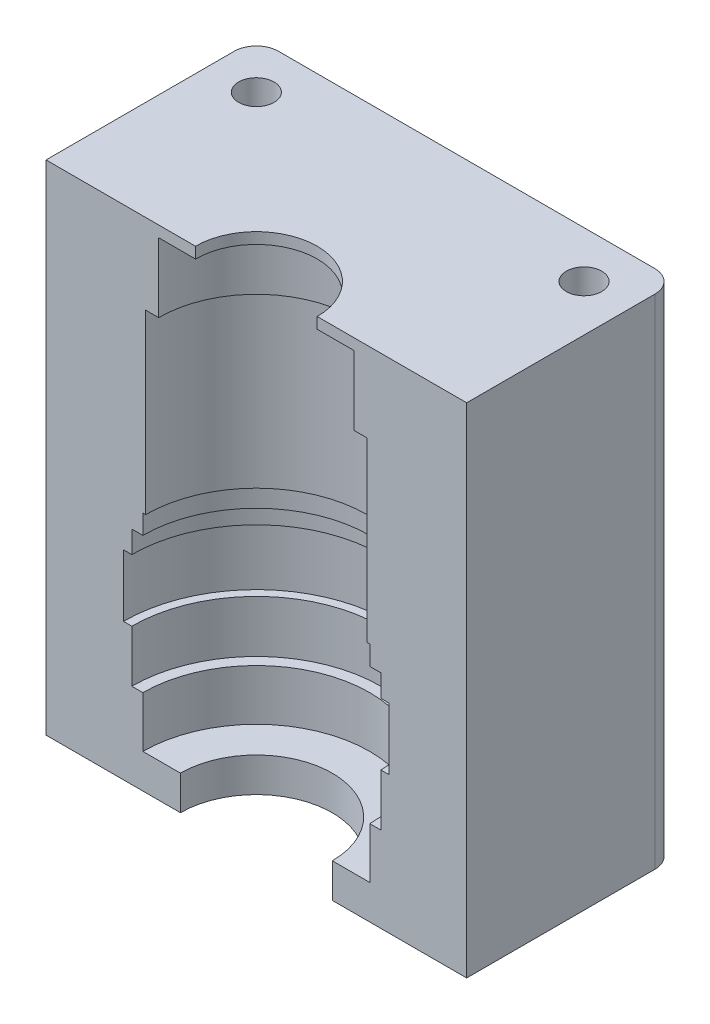
ISO-10303-21;
HEADER;
FILE_DESCRIPTION(('STEP AP214'),'2;1');
FILE_NAME('part.step','',(''),(''),'','','');
FILE_SCHEMA(('AUTOMOTIVE_DESIGN { 1 0 10303 214 1 1 1 1 }'));
ENDSEC;
DATA;
#1=APPLICATION_CONTEXT('core data for automotive mechanical design processes');
#2=APPLICATION_PROTOCOL_DEFINITION('international standard','automotive_design',2000,#1);
#3=PRODUCT_CONTEXT('',#1,'mechanical');
#4=PRODUCT('Part','Part','',(#3));
#5=PRODUCT_RELATED_PRODUCT_CATEGORY('part','',(#4));
#6=PRODUCT_DEFINITION_FORMATION('','',#4);
#7=PRODUCT_DEFINITION_CONTEXT('part definition',#1,'design');
#8=PRODUCT_DEFINITION('design','',#6,#7);
#9=PRODUCT_DEFINITION_SHAPE('','',#8);
#10=(LENGTH_UNIT() NAMED_UNIT(*) SI_UNIT(.MILLI.,.METRE.));
#11=(NAMED_UNIT(*) PLANE_ANGLE_UNIT() SI_UNIT($,.RADIAN.));
#12=(NAMED_UNIT(*) SI_UNIT($,.STERADIAN.) SOLID_ANGLE_UNIT());
#13=UNCERTAINTY_MEASURE_WITH_UNIT(LENGTH_MEASURE(1.E-05),#10,'distance_accuracy_value','');
#14=(GEOMETRIC_REPRESENTATION_CONTEXT(3) GLOBAL_UNCERTAINTY_ASSIGNED_CONTEXT((#13)) GLOBAL_UNIT_ASSIGNED_CONTEXT((#10,
#11,#12)) REPRESENTATION_CONTEXT('',''));
#15=CARTESIAN_POINT('',(0.,0.,0.));
#16=DIRECTION('',(0.,0.,1.));
#17=DIRECTION('',(1.,0.,0.));
#18=AXIS2_PLACEMENT_3D('',#15,#16,#17);
#19=CARTESIAN_POINT('',(0.,0.,0.));
#20=DIRECTION('',(0.,0.,1.));
#21=DIRECTION('',(1.,0.,0.));
#22=AXIS2_PLACEMENT_3D('',#19,#20,#21);
#23=PLANE('',#22);
#24=DIRECTION('',(1.,0.,0.));
#25=VECTOR('',#24,1.);
#26=CARTESIAN_POINT('',(0.,46.6,0.));
#27=LINE('',#26,#25);
#28=CARTESIAN_POINT('',(6.85772410593546,46.6,0.));
#29=VERTEX_POINT('',#28);
#30=CARTESIAN_POINT('',(10.25,46.6,0.));
#31=VERTEX_POINT('',#30);
#32=EDGE_CURVE('E11',#29,#31,#27,.T.);
#33=ORIENTED_EDGE('',*,*,#32,.F.);
#34=DIRECTION('',(0.,-1.,0.));
#35=VECTOR('',#34,1.);
#36=CARTESIAN_POINT('',(6.85772410593546,88.5,0.));
#37=LINE('',#36,#35);
#38=CARTESIAN_POINT('',(6.85772410593546,43.5,0.));
#39=VERTEX_POINT('',#38);
#40=EDGE_CURVE('E248',#39,#29,#37,.F.);
#41=ORIENTED_EDGE('',*,*,#40,.F.);
#42=DIRECTION('',(1.,0.,0.));
#43=VECTOR('',#42,1.);
#44=CARTESIAN_POINT('',(-17.,43.5,0.));
#45=LINE('',#44,#43);
#46=CARTESIAN_POINT('',(19.,43.5,0.));
#47=VERTEX_POINT('',#46);
#48=EDGE_CURVE('E286',#39,#47,#45,.T.);
#49=ORIENTED_EDGE('',*,*,#48,.T.);
#50=DIRECTION('',(0.,1.,0.));
#51=VECTOR('',#50,1.);
#52=CARTESIAN_POINT('',(19.,88.5,0.));
#53=LINE('',#52,#51);
#54=CARTESIAN_POINT('',(19.,88.5,0.));
#55=VERTEX_POINT('',#54);
#56=EDGE_CURVE('E290',#47,#55,#53,.T.);
#57=ORIENTED_EDGE('',*,*,#56,.T.);
#58=DIRECTION('',(1.,0.,0.));
#59=VECTOR('',#58,1.);
#60=CARTESIAN_POINT('',(-17.,88.5,0.));
#61=LINE('',#60,#59);
#62=CARTESIAN_POINT('',(5.5,88.5,0.));
#63=VERTEX_POINT('',#62);
#64=EDGE_CURVE('E231',#63,#55,#61,.T.);
#65=ORIENTED_EDGE('',*,*,#64,.F.);
#66=DIRECTION('',(0.,1.,0.));
#67=VECTOR('',#66,1.);
#68=CARTESIAN_POINT('',(5.5,88.5,0.));
#69=LINE('',#68,#67);
#70=CARTESIAN_POINT('',(5.5,87.5,0.));
#71=VERTEX_POINT('',#70);
#72=EDGE_CURVE('E58',#71,#63,#69,.T.);
#73=ORIENTED_EDGE('',*,*,#72,.F.);
#74=DIRECTION('',(-1.,0.,0.));
#75=VECTOR('',#74,1.);
#76=CARTESIAN_POINT('',(0.,87.5,0.));
#77=LINE('',#76,#75);
#78=CARTESIAN_POINT('',(8.825,87.5,0.));
#79=VERTEX_POINT('',#78);
#80=EDGE_CURVE('E213',#79,#71,#77,.T.);
#81=ORIENTED_EDGE('',*,*,#80,.F.);
#82=DIRECTION('',(0.,1.,0.));
#83=VECTOR('',#82,1.);
#84=CARTESIAN_POINT('',(8.825,88.5,0.));
#85=LINE('',#84,#83);
#86=CARTESIAN_POINT('',(8.825,81.25,0.));
#87=VERTEX_POINT('',#86);
#88=EDGE_CURVE('E221',#87,#79,#85,.T.);
#89=ORIENTED_EDGE('',*,*,#88,.F.);
#90=DIRECTION('',(-1.,0.,0.));
#91=VECTOR('',#90,1.);
#92=CARTESIAN_POINT('',(0.,81.25,0.));
#93=LINE('',#92,#91);
#94=CARTESIAN_POINT('',(10.,81.25,0.));
#95=VERTEX_POINT('',#94);
#96=EDGE_CURVE('E305',#95,#87,#93,.T.);
#97=ORIENTED_EDGE('',*,*,#96,.F.);
#98=DIRECTION('',(0.,1.,0.));
#99=VECTOR('',#98,1.);
#100=CARTESIAN_POINT('',(10.,88.5,0.));
#101=LINE('',#100,#99);
#102=CARTESIAN_POINT('',(10.,65.25,0.));
#103=VERTEX_POINT('',#102);
#104=EDGE_CURVE('E334',#103,#95,#101,.T.);
#105=ORIENTED_EDGE('',*,*,#104,.F.);
#106=DIRECTION('',(-1.,0.,0.));
#107=VECTOR('',#106,1.);
#108=CARTESIAN_POINT('',(0.,65.25,0.));
#109=LINE('',#108,#107);
#110=CARTESIAN_POINT('',(10.25,65.25,0.));
#111=VERTEX_POINT('',#110);
#112=EDGE_CURVE('E310',#111,#103,#109,.T.);
#113=ORIENTED_EDGE('',*,*,#112,.F.);
#114=DIRECTION('',(0.,1.,0.));
#115=VECTOR('',#114,1.);
#116=CARTESIAN_POINT('',(10.25,88.5,0.));
#117=LINE('',#116,#115);
#118=CARTESIAN_POINT('',(10.25,63.5,0.));
#119=VERTEX_POINT('',#118);
#120=EDGE_CURVE('E336',#119,#111,#117,.T.);
#121=ORIENTED_EDGE('',*,*,#120,.F.);
#122=DIRECTION('',(-1.,0.,0.));
#123=VECTOR('',#122,1.);
#124=CARTESIAN_POINT('',(0.,63.5,0.));
#125=LINE('',#124,#123);
#126=CARTESIAN_POINT('',(11.25,63.5,0.));
#127=VERTEX_POINT('',#126);
#128=EDGE_CURVE('E315',#127,#119,#125,.T.);
#129=ORIENTED_EDGE('',*,*,#128,.F.);
#130=DIRECTION('',(0.,1.,0.));
#131=VECTOR('',#130,1.);
#132=CARTESIAN_POINT('',(11.25,88.5,0.));
#133=LINE('',#132,#131);
#134=CARTESIAN_POINT('',(11.25,61.5,0.));
#135=VERTEX_POINT('',#134);
#136=EDGE_CURVE('E338',#135,#127,#133,.T.);
#137=ORIENTED_EDGE('',*,*,#136,.F.);
#138=DIRECTION('',(-1.,0.,0.));
#139=VECTOR('',#138,1.);
#140=CARTESIAN_POINT('',(0.,61.5,0.));
#141=LINE('',#140,#139);
#142=CARTESIAN_POINT('',(12.,61.5,0.));
#143=VERTEX_POINT('',#142);
#144=EDGE_CURVE('E320',#143,#135,#141,.T.);
#145=ORIENTED_EDGE('',*,*,#144,.F.);
#146=DIRECTION('',(0.,1.,0.));
#147=VECTOR('',#146,1.);
#148=CARTESIAN_POINT('',(12.,88.5,0.));
#149=LINE('',#148,#147);
#150=CARTESIAN_POINT('',(12.,55.9,0.));
#151=VERTEX_POINT('',#150);
#152=EDGE_CURVE('E340',#151,#143,#149,.T.);
#153=ORIENTED_EDGE('',*,*,#152,.F.);
#154=DIRECTION('',(-1.,0.,0.));
#155=VECTOR('',#154,1.);
#156=CARTESIAN_POINT('',(0.,55.9,0.));
#157=LINE('',#156,#155);
#158=CARTESIAN_POINT('',(11.25,55.9,0.));
#159=VERTEX_POINT('',#158);
#160=EDGE_CURVE('E326',#151,#159,#157,.T.);
#161=ORIENTED_EDGE('',*,*,#160,.T.);
#162=DIRECTION('',(0.,1.,0.));
#163=VECTOR('',#162,1.);
#164=CARTESIAN_POINT('',(11.25,88.5,0.));
#165=LINE('',#164,#163);
#166=CARTESIAN_POINT('',(11.25,51.2,0.));
#167=VERTEX_POINT('',#166);
#168=EDGE_CURVE('E341',#167,#159,#165,.T.);
#169=ORIENTED_EDGE('',*,*,#168,.F.);
#170=DIRECTION('',(1.,0.,0.));
#171=VECTOR('',#170,1.);
#172=CARTESIAN_POINT('',(0.,51.2,0.));
#173=LINE('',#172,#171);
#174=CARTESIAN_POINT('',(10.25,51.2,0.));
#175=VERTEX_POINT('',#174);
#176=EDGE_CURVE('E331',#175,#167,#173,.T.);
#177=ORIENTED_EDGE('',*,*,#176,.F.);
#178=DIRECTION('',(0.,1.,0.));
#179=VECTOR('',#178,1.);
#180=CARTESIAN_POINT('',(10.25,88.5,0.));
#181=LINE('',#180,#179);
#182=EDGE_CURVE('E45',#31,#175,#181,.T.);
#183=ORIENTED_EDGE('',*,*,#182,.F.);
#184=EDGE_LOOP('',(#33,#41,#49,#57,#65,#73,#81,#89,#97,#105,#113,#121,#129,#137,#145,#153,#161,
#169,#177,#183));
#185=FACE_BOUND('',#184,.T.);
#186=ADVANCED_FACE('F41',(#185),#23,.T.);
#187=CARTESIAN_POINT('',(0.,88.5,0.));
#188=DIRECTION('',(0.,-1.,0.));
#189=DIRECTION('',(0.,0.,-1.));
#190=AXIS2_PLACEMENT_3D('',#187,#188,#189);
#191=CYLINDRICAL_SURFACE('',#190,6.85772410593546);
#192=CARTESIAN_POINT('',(0.,46.6,0.));
#193=DIRECTION('',(0.,-1.,0.));
#194=DIRECTION('',(0.,0.,-1.));
#195=AXIS2_PLACEMENT_3D('',#192,#193,#194);
#196=CIRCLE('',#195,6.85772410593546);
#197=CARTESIAN_POINT('',(-6.85772410593546,46.6,0.));
#198=VERTEX_POINT('',#197);
#199=EDGE_CURVE('E232',#198,#29,#196,.T.);
#200=ORIENTED_EDGE('',*,*,#199,.F.);
#201=DIRECTION('',(0.,-1.,0.));
#202=VECTOR('',#201,1.);
#203=CARTESIAN_POINT('',(-6.85772410593546,88.5,0.));
#204=LINE('',#203,#202);
#205=CARTESIAN_POINT('',(-6.85772410593546,43.5,0.));
#206=VERTEX_POINT('',#205);
#207=EDGE_CURVE('E281',#198,#206,#204,.T.);
#208=ORIENTED_EDGE('',*,*,#207,.T.);
#209=CARTESIAN_POINT('',(0.,43.5,0.));
#210=DIRECTION('',(0.,1.,0.));
#211=DIRECTION('',(0.,0.,1.));
#212=AXIS2_PLACEMENT_3D('',#209,#210,#211);
#213=CIRCLE('',#212,6.85772410593546);
#214=EDGE_CURVE('E242',#39,#206,#213,.T.);
#215=ORIENTED_EDGE('',*,*,#214,.F.);
#216=ORIENTED_EDGE('',*,*,#40,.T.);
#217=EDGE_LOOP('',(#200,#208,#215,#216));
#218=FACE_BOUND('',#217,.T.);
#219=ADVANCED_FACE('F43',(#218),#191,.F.);
#220=CARTESIAN_POINT('',(-10.25,46.6,0.));
#221=VERTEX_POINT('',#220);
#222=EDGE_CURVE('E51',#221,#198,#27,.T.);
#223=ORIENTED_EDGE('',*,*,#222,.F.);
#224=DIRECTION('',(0.,1.,0.));
#225=VECTOR('',#224,1.);
#226=CARTESIAN_POINT('',(-10.25,88.5,0.));
#227=LINE('',#226,#225);
#228=CARTESIAN_POINT('',(-10.25,51.2,0.));
#229=VERTEX_POINT('',#228);
#230=EDGE_CURVE('E330',#229,#221,#227,.F.);
#231=ORIENTED_EDGE('',*,*,#230,.F.);
#232=CARTESIAN_POINT('',(-11.25,51.2,0.));
#233=VERTEX_POINT('',#232);
#234=EDGE_CURVE('E328',#233,#229,#173,.T.);
#235=ORIENTED_EDGE('',*,*,#234,.F.);
#236=DIRECTION('',(0.,1.,0.));
#237=VECTOR('',#236,1.);
#238=CARTESIAN_POINT('',(-11.25,88.5,0.));
#239=LINE('',#238,#237);
#240=CARTESIAN_POINT('',(-11.25,55.9,0.));
#241=VERTEX_POINT('',#240);
#242=EDGE_CURVE('E325',#241,#233,#239,.F.);
#243=ORIENTED_EDGE('',*,*,#242,.F.);
#244=CARTESIAN_POINT('',(-12.,55.9,0.));
#245=VERTEX_POINT('',#244);
#246=EDGE_CURVE('E322',#241,#245,#157,.T.);
#247=ORIENTED_EDGE('',*,*,#246,.T.);
#248=DIRECTION('',(0.,1.,0.));
#249=VECTOR('',#248,1.);
#250=CARTESIAN_POINT('',(-12.,88.5,0.));
#251=LINE('',#250,#249);
#252=CARTESIAN_POINT('',(-12.,61.5,0.));
#253=VERTEX_POINT('',#252);
#254=EDGE_CURVE('E319',#253,#245,#251,.F.);
#255=ORIENTED_EDGE('',*,*,#254,.F.);
#256=CARTESIAN_POINT('',(-11.25,61.5,0.));
#257=VERTEX_POINT('',#256);
#258=EDGE_CURVE('E317',#257,#253,#141,.T.);
#259=ORIENTED_EDGE('',*,*,#258,.F.);
#260=DIRECTION('',(0.,1.,0.));
#261=VECTOR('',#260,1.);
#262=CARTESIAN_POINT('',(-11.25,88.5,0.));
#263=LINE('',#262,#261);
#264=CARTESIAN_POINT('',(-11.25,63.5,0.));
#265=VERTEX_POINT('',#264);
#266=EDGE_CURVE('E314',#265,#257,#263,.F.);
#267=ORIENTED_EDGE('',*,*,#266,.F.);
#268=CARTESIAN_POINT('',(-10.25,63.5,0.));
#269=VERTEX_POINT('',#268);
#270=EDGE_CURVE('E312',#269,#265,#125,.T.);
#271=ORIENTED_EDGE('',*,*,#270,.F.);
#272=DIRECTION('',(0.,1.,0.));
#273=VECTOR('',#272,1.);
#274=CARTESIAN_POINT('',(-10.25,88.5,0.));
#275=LINE('',#274,#273);
#276=CARTESIAN_POINT('',(-10.25,65.25,0.));
#277=VERTEX_POINT('',#276);
#278=EDGE_CURVE('E309',#277,#269,#275,.F.);
#279=ORIENTED_EDGE('',*,*,#278,.F.);
#280=CARTESIAN_POINT('',(-10.,65.25,0.));
#281=VERTEX_POINT('',#280);
#282=EDGE_CURVE('E307',#281,#277,#109,.T.);
#283=ORIENTED_EDGE('',*,*,#282,.F.);
#284=DIRECTION('',(0.,1.,0.));
#285=VECTOR('',#284,1.);
#286=CARTESIAN_POINT('',(-10.,88.5,0.));
#287=LINE('',#286,#285);
#288=CARTESIAN_POINT('',(-10.,81.25,0.));
#289=VERTEX_POINT('',#288);
#290=EDGE_CURVE('E304',#289,#281,#287,.F.);
#291=ORIENTED_EDGE('',*,*,#290,.F.);
#292=CARTESIAN_POINT('',(-8.825,81.25,0.));
#293=VERTEX_POINT('',#292);
#294=EDGE_CURVE('E302',#293,#289,#93,.T.);
#295=ORIENTED_EDGE('',*,*,#294,.F.);
#296=DIRECTION('',(0.,1.,0.));
#297=VECTOR('',#296,1.);
#298=CARTESIAN_POINT('',(-8.825,88.5,0.));
#299=LINE('',#298,#297);
#300=CARTESIAN_POINT('',(-8.825,87.5,0.));
#301=VERTEX_POINT('',#300);
#302=EDGE_CURVE('E300',#301,#293,#299,.F.);
#303=ORIENTED_EDGE('',*,*,#302,.F.);
#304=CARTESIAN_POINT('',(-5.5,87.5,0.));
#305=VERTEX_POINT('',#304);
#306=EDGE_CURVE('E223',#305,#301,#77,.T.);
#307=ORIENTED_EDGE('',*,*,#306,.F.);
#308=DIRECTION('',(0.,1.,0.));
#309=VECTOR('',#308,1.);
#310=CARTESIAN_POINT('',(-5.5,88.5,0.));
#311=LINE('',#310,#309);
#312=CARTESIAN_POINT('',(-5.5,88.5,0.));
#313=VERTEX_POINT('',#312);
#314=EDGE_CURVE('E226',#313,#305,#311,.F.);
#315=ORIENTED_EDGE('',*,*,#314,.F.);
#316=CARTESIAN_POINT('',(-19.,88.5,0.));
#317=VERTEX_POINT('',#316);
#318=EDGE_CURVE('E283',#317,#313,#61,.T.);
#319=ORIENTED_EDGE('',*,*,#318,.F.);
#320=DIRECTION('',(0.,-1.,0.));
#321=VECTOR('',#320,1.);
#322=CARTESIAN_POINT('',(-19.,88.5,0.));
#323=LINE('',#322,#321);
#324=CARTESIAN_POINT('',(-19.,43.5,0.));
#325=VERTEX_POINT('',#324);
#326=EDGE_CURVE('E234',#317,#325,#323,.T.);
#327=ORIENTED_EDGE('',*,*,#326,.T.);
#328=EDGE_CURVE('E289',#325,#206,#45,.T.);
#329=ORIENTED_EDGE('',*,*,#328,.T.);
#330=ORIENTED_EDGE('',*,*,#207,.F.);
#331=EDGE_LOOP('',(#223,#231,#235,#243,#247,#255,#259,#267,#271,#279,#283,#291,#295,#303,#307,
#315,#319,#327,#329,#330));
#332=FACE_BOUND('',#331,.T.);
#333=ADVANCED_FACE('F409',(#332),#23,.T.);
#334=CARTESIAN_POINT('',(17.,88.5,-19.));
#335=DIRECTION('',(0.,0.,1.));
#336=DIRECTION('',(1.,0.,0.));
#337=AXIS2_PLACEMENT_3D('',#334,#335,#336);
#338=PLANE('',#337);
#339=DIRECTION('',(0.,-1.,0.));
#340=VECTOR('',#339,1.);
#341=CARTESIAN_POINT('',(-17.,88.5,-19.));
#342=LINE('',#341,#340);
#343=CARTESIAN_POINT('',(-17.,88.5,-19.));
#344=VERTEX_POINT('',#343);
#345=CARTESIAN_POINT('',(-17.,43.5,-19.));
#346=VERTEX_POINT('',#345);
#347=EDGE_CURVE('E250',#344,#346,#342,.T.);
#348=ORIENTED_EDGE('',*,*,#347,.F.);
#349=DIRECTION('',(1.,0.,0.));
#350=VECTOR('',#349,1.);
#351=CARTESIAN_POINT('',(-17.,88.5,-19.));
#352=LINE('',#351,#350);
#353=CARTESIAN_POINT('',(17.,88.5,-19.));
#354=VERTEX_POINT('',#353);
#355=EDGE_CURVE('E272',#344,#354,#352,.T.);
#356=ORIENTED_EDGE('',*,*,#355,.T.);
#357=DIRECTION('',(0.,-1.,0.));
#358=VECTOR('',#357,1.);
#359=CARTESIAN_POINT('',(17.,88.5,-19.));
#360=LINE('',#359,#358);
#361=CARTESIAN_POINT('',(17.,43.5,-19.));
#362=VERTEX_POINT('',#361);
#363=EDGE_CURVE('E247',#354,#362,#360,.T.);
#364=ORIENTED_EDGE('',*,*,#363,.T.);
#365=DIRECTION('',(-1.,0.,0.));
#366=VECTOR('',#365,1.);
#367=CARTESIAN_POINT('',(17.,43.5,-19.));
#368=LINE('',#367,#366);
#369=EDGE_CURVE('E258',#362,#346,#368,.T.);
#370=ORIENTED_EDGE('',*,*,#369,.T.);
#371=EDGE_LOOP('',(#348,#356,#364,#370));
#372=FACE_BOUND('',#371,.T.);
#373=ADVANCED_FACE('F434',(#372),#338,.F.);
#374=CARTESIAN_POINT('',(14.8,88.5,-14.8));
#375=DIRECTION('',(0.,-1.,0.));
#376=DIRECTION('',(0.,0.,-1.));
#377=AXIS2_PLACEMENT_3D('',#374,#375,#376);
#378=CYLINDRICAL_SURFACE('',#377,1.6);
#379=CARTESIAN_POINT('',(14.8,88.5,-14.8));
#380=DIRECTION('',(0.,-1.,0.));
#381=DIRECTION('',(0.,0.,-1.));
#382=AXIS2_PLACEMENT_3D('',#379,#380,#381);
#383=CIRCLE('',#382,1.6);
#384=CARTESIAN_POINT('',(14.8,88.5,-16.4));
#385=VERTEX_POINT('',#384);
#386=EDGE_CURVE('E245',#385,#385,#383,.T.);
#387=ORIENTED_EDGE('',*,*,#386,.F.);
#388=EDGE_LOOP('',(#387));
#389=FACE_BOUND('',#388,.T.);
#390=CARTESIAN_POINT('',(14.8,43.5,-14.8));
#391=DIRECTION('',(0.,1.,0.));
#392=DIRECTION('',(0.,0.,1.));
#393=AXIS2_PLACEMENT_3D('',#390,#391,#392);
#394=CIRCLE('',#393,1.6);
#395=CARTESIAN_POINT('',(14.8,43.5,-13.2));
#396=VERTEX_POINT('',#395);
#397=EDGE_CURVE('E238',#396,#396,#394,.T.);
#398=ORIENTED_EDGE('',*,*,#397,.F.);
#399=EDGE_LOOP('',(#398));
#400=FACE_BOUND('',#399,.T.);
#401=ADVANCED_FACE('F501',(#389,#400),#378,.F.);
#402=CARTESIAN_POINT('',(-14.8,88.5,-14.8));
#403=DIRECTION('',(0.,-1.,0.));
#404=DIRECTION('',(0.,0.,-1.));
#405=AXIS2_PLACEMENT_3D('',#402,#403,#404);
#406=CYLINDRICAL_SURFACE('',#405,1.6);
#407=CARTESIAN_POINT('',(-14.8,88.5,-14.8));
#408=DIRECTION('',(0.,-1.,0.));
#409=DIRECTION('',(0.,0.,-1.));
#410=AXIS2_PLACEMENT_3D('',#407,#408,#409);
#411=CIRCLE('',#410,1.6);
#412=CARTESIAN_POINT('',(-14.8,88.5,-16.4));
#413=VERTEX_POINT('',#412);
#414=EDGE_CURVE('E264',#413,#413,#411,.T.);
#415=ORIENTED_EDGE('',*,*,#414,.F.);
#416=EDGE_LOOP('',(#415));
#417=FACE_BOUND('',#416,.T.);
#418=CARTESIAN_POINT('',(-14.8,43.5,-14.8));
#419=DIRECTION('',(0.,1.,0.));
#420=DIRECTION('',(0.,0.,1.));
#421=AXIS2_PLACEMENT_3D('',#418,#419,#420);
#422=CIRCLE('',#421,1.6);
#423=CARTESIAN_POINT('',(-14.8,43.5,-13.2));
#424=VERTEX_POINT('',#423);
#425=EDGE_CURVE('E241',#424,#424,#422,.T.);
#426=ORIENTED_EDGE('',*,*,#425,.F.);
#427=EDGE_LOOP('',(#426));
#428=FACE_BOUND('',#427,.T.);
#429=ADVANCED_FACE('F682',(#417,#428),#406,.F.);
#430=CARTESIAN_POINT('',(17.,88.5,-17.));
#431=DIRECTION('',(0.,-1.,0.));
#432=DIRECTION('',(0.,0.,-1.));
#433=AXIS2_PLACEMENT_3D('',#430,#431,#432);
#434=CYLINDRICAL_SURFACE('',#433,2.);
#435=ORIENTED_EDGE('',*,*,#363,.F.);
#436=CARTESIAN_POINT('',(17.,88.5,-17.));
#437=DIRECTION('',(0.,1.,0.));
#438=DIRECTION('',(0.,0.,1.));
#439=AXIS2_PLACEMENT_3D('',#436,#437,#438);
#440=CIRCLE('',#439,2.);
#441=CARTESIAN_POINT('',(19.,88.5,-17.));
#442=VERTEX_POINT('',#441);
#443=EDGE_CURVE('E275',#354,#442,#440,.F.);
#444=ORIENTED_EDGE('',*,*,#443,.T.);
#445=DIRECTION('',(0.,-1.,0.));
#446=VECTOR('',#445,1.);
#447=CARTESIAN_POINT('',(19.,88.5,-17.));
#448=LINE('',#447,#446);
#449=CARTESIAN_POINT('',(19.,43.5,-17.));
#450=VERTEX_POINT('',#449);
#451=EDGE_CURVE('E67',#442,#450,#448,.T.);
#452=ORIENTED_EDGE('',*,*,#451,.T.);
#453=CARTESIAN_POINT('',(17.,43.5,-17.));
#454=DIRECTION('',(0.,1.,0.));
#455=DIRECTION('',(0.,0.,1.));
#456=AXIS2_PLACEMENT_3D('',#453,#454,#455);
#457=CIRCLE('',#456,2.);
#458=EDGE_CURVE('E261',#450,#362,#457,.T.);
#459=ORIENTED_EDGE('',*,*,#458,.T.);
#460=EDGE_LOOP('',(#435,#444,#452,#459));
#461=FACE_BOUND('',#460,.T.);
#462=ADVANCED_FACE('F431',(#461),#434,.T.);
#463=CARTESIAN_POINT('',(-17.,88.5,-17.));
#464=DIRECTION('',(0.,-1.,0.));
#465=DIRECTION('',(0.,0.,-1.));
#466=AXIS2_PLACEMENT_3D('',#463,#464,#465);
#467=CYLINDRICAL_SURFACE('',#466,2.);
#468=DIRECTION('',(0.,-1.,0.));
#469=VECTOR('',#468,1.);
#470=CARTESIAN_POINT('',(-19.,88.5,-17.));
#471=LINE('',#470,#469);
#472=CARTESIAN_POINT('',(-19.,88.5,-17.));
#473=VERTEX_POINT('',#472);
#474=CARTESIAN_POINT('',(-19.,43.5,-17.));
#475=VERTEX_POINT('',#474);
#476=EDGE_CURVE('E252',#473,#475,#471,.T.);
#477=ORIENTED_EDGE('',*,*,#476,.F.);
#478=CARTESIAN_POINT('',(-17.,88.5,-17.));
#479=DIRECTION('',(0.,1.,0.));
#480=DIRECTION('',(0.,0.,1.));
#481=AXIS2_PLACEMENT_3D('',#478,#479,#480);
#482=CIRCLE('',#481,2.);
#483=EDGE_CURVE('E269',#473,#344,#482,.F.);
#484=ORIENTED_EDGE('',*,*,#483,.T.);
#485=ORIENTED_EDGE('',*,*,#347,.T.);
#486=CARTESIAN_POINT('',(-17.,43.5,-17.));
#487=DIRECTION('',(0.,1.,0.));
#488=DIRECTION('',(0.,0.,1.));
#489=AXIS2_PLACEMENT_3D('',#486,#487,#488);
#490=CIRCLE('',#489,2.);
#491=EDGE_CURVE('E255',#346,#475,#490,.T.);
#492=ORIENTED_EDGE('',*,*,#491,.T.);
#493=EDGE_LOOP('',(#477,#484,#485,#492));
#494=FACE_BOUND('',#493,.T.);
#495=ADVANCED_FACE('F438',(#494),#467,.T.);
#496=CARTESIAN_POINT('',(-17.,43.5,17.));
#497=DIRECTION('',(0.,1.,0.));
#498=DIRECTION('',(0.,0.,1.));
#499=AXIS2_PLACEMENT_3D('',#496,#497,#498);
#500=PLANE('',#499);
#501=ORIENTED_EDGE('',*,*,#425,.T.);
#502=EDGE_LOOP('',(#501));
#503=FACE_BOUND('',#502,.T.);
#504=ORIENTED_EDGE('',*,*,#397,.T.);
#505=EDGE_LOOP('',(#504));
#506=FACE_BOUND('',#505,.T.);
#507=ORIENTED_EDGE('',*,*,#328,.F.);
#508=DIRECTION('',(0.,0.,1.));
#509=VECTOR('',#508,1.);
#510=CARTESIAN_POINT('',(-19.,43.5,-17.));
#511=LINE('',#510,#509);
#512=EDGE_CURVE('E254',#475,#325,#511,.T.);
#513=ORIENTED_EDGE('',*,*,#512,.F.);
#514=ORIENTED_EDGE('',*,*,#491,.F.);
#515=ORIENTED_EDGE('',*,*,#369,.F.);
#516=ORIENTED_EDGE('',*,*,#458,.F.);
#517=DIRECTION('',(0.,0.,-1.));
#518=VECTOR('',#517,1.);
#519=CARTESIAN_POINT('',(19.,43.5,17.));
#520=LINE('',#519,#518);
#521=EDGE_CURVE('E87',#47,#450,#520,.T.);
#522=ORIENTED_EDGE('',*,*,#521,.F.);
#523=ORIENTED_EDGE('',*,*,#48,.F.);
#524=ORIENTED_EDGE('',*,*,#214,.T.);
#525=EDGE_LOOP('',(#507,#513,#514,#515,#516,#522,#523,#524));
#526=FACE_BOUND('',#525,.T.);
#527=ADVANCED_FACE('F421',(#503,#506,#526),#500,.F.);
#528=CARTESIAN_POINT('',(-17.,88.5,17.));
#529=DIRECTION('',(0.,1.,0.));
#530=DIRECTION('',(0.,0.,1.));
#531=AXIS2_PLACEMENT_3D('',#528,#529,#530);
#532=PLANE('',#531);
#533=CARTESIAN_POINT('',(0.,88.5,0.));
#534=DIRECTION('',(0.,1.,0.));
#535=DIRECTION('',(0.,0.,1.));
#536=AXIS2_PLACEMENT_3D('',#533,#534,#535);
#537=CIRCLE('',#536,5.5);
#538=EDGE_CURVE('E391',#63,#313,#537,.T.);
#539=ORIENTED_EDGE('',*,*,#538,.F.);
#540=ORIENTED_EDGE('',*,*,#64,.T.);
#541=DIRECTION('',(0.,0.,1.));
#542=VECTOR('',#541,1.);
#543=CARTESIAN_POINT('',(19.,88.5,-17.));
#544=LINE('',#543,#542);
#545=EDGE_CURVE('E278',#442,#55,#544,.T.);
#546=ORIENTED_EDGE('',*,*,#545,.F.);
#547=ORIENTED_EDGE('',*,*,#443,.F.);
#548=ORIENTED_EDGE('',*,*,#355,.F.);
#549=ORIENTED_EDGE('',*,*,#483,.F.);
#550=DIRECTION('',(0.,0.,-1.));
#551=VECTOR('',#550,1.);
#552=CARTESIAN_POINT('',(-19.,88.5,17.));
#553=LINE('',#552,#551);
#554=EDGE_CURVE('E80',#317,#473,#553,.T.);
#555=ORIENTED_EDGE('',*,*,#554,.F.);
#556=ORIENTED_EDGE('',*,*,#318,.T.);
#557=EDGE_LOOP('',(#539,#540,#546,#547,#548,#549,#555,#556));
#558=FACE_BOUND('',#557,.T.);
#559=ORIENTED_EDGE('',*,*,#414,.T.);
#560=EDGE_LOOP('',(#559));
#561=FACE_BOUND('',#560,.T.);
#562=ORIENTED_EDGE('',*,*,#386,.T.);
#563=EDGE_LOOP('',(#562));
#564=FACE_BOUND('',#563,.T.);
#565=ADVANCED_FACE('F427',(#558,#561,#564),#532,.T.);
#566=CARTESIAN_POINT('',(-19.,88.5,-17.));
#567=DIRECTION('',(1.,0.,0.));
#568=DIRECTION('',(0.,0.,-1.));
#569=AXIS2_PLACEMENT_3D('',#566,#567,#568);
#570=PLANE('',#569);
#571=ORIENTED_EDGE('',*,*,#326,.F.);
#572=ORIENTED_EDGE('',*,*,#554,.T.);
#573=ORIENTED_EDGE('',*,*,#476,.T.);
#574=ORIENTED_EDGE('',*,*,#512,.T.);
#575=EDGE_LOOP('',(#571,#572,#573,#574));
#576=FACE_BOUND('',#575,.T.);
#577=ADVANCED_FACE('F439',(#576),#570,.F.);
#578=CARTESIAN_POINT('',(19.,88.5,17.));
#579=DIRECTION('',(-1.,0.,0.));
#580=DIRECTION('',(0.,0.,1.));
#581=AXIS2_PLACEMENT_3D('',#578,#579,#580);
#582=PLANE('',#581);
#583=ORIENTED_EDGE('',*,*,#56,.F.);
#584=ORIENTED_EDGE('',*,*,#521,.T.);
#585=ORIENTED_EDGE('',*,*,#451,.F.);
#586=ORIENTED_EDGE('',*,*,#545,.T.);
#587=EDGE_LOOP('',(#583,#584,#585,#586));
#588=FACE_BOUND('',#587,.T.);
#589=ADVANCED_FACE('F424',(#588),#582,.F.);
#590=CARTESIAN_POINT('',(0.,87.5,0.));
#591=DIRECTION('',(0.,1.,0.));
#592=DIRECTION('',(0.,0.,1.));
#593=AXIS2_PLACEMENT_3D('',#590,#591,#592);
#594=PLANE('',#593);
#595=ORIENTED_EDGE('',*,*,#80,.T.);
#596=CARTESIAN_POINT('',(0.,87.5,0.));
#597=DIRECTION('',(0.,1.,0.));
#598=DIRECTION('',(0.,0.,1.));
#599=AXIS2_PLACEMENT_3D('',#596,#597,#598);
#600=CIRCLE('',#599,5.5);
#601=EDGE_CURVE('E215',#71,#305,#600,.T.);
#602=ORIENTED_EDGE('',*,*,#601,.T.);
#603=ORIENTED_EDGE('',*,*,#306,.T.);
#604=CARTESIAN_POINT('',(0.,87.5,0.));
#605=DIRECTION('',(0.,1.,0.));
#606=DIRECTION('',(0.,0.,1.));
#607=AXIS2_PLACEMENT_3D('',#604,#605,#606);
#608=CIRCLE('',#607,8.825);
#609=EDGE_CURVE('E218',#79,#301,#608,.T.);
#610=ORIENTED_EDGE('',*,*,#609,.F.);
#611=EDGE_LOOP('',(#595,#602,#603,#610));
#612=FACE_BOUND('',#611,.T.);
#613=ADVANCED_FACE('F214',(#612),#594,.F.);
#614=CARTESIAN_POINT('',(0.,88.5,0.));
#615=DIRECTION('',(0.,1.,0.));
#616=DIRECTION('',(0.,0.,1.));
#617=AXIS2_PLACEMENT_3D('',#614,#615,#616);
#618=CYLINDRICAL_SURFACE('',#617,8.825);
#619=ORIENTED_EDGE('',*,*,#88,.T.);
#620=ORIENTED_EDGE('',*,*,#609,.T.);
#621=ORIENTED_EDGE('',*,*,#302,.T.);
#622=CARTESIAN_POINT('',(0.,81.25,0.));
#623=DIRECTION('',(0.,1.,0.));
#624=DIRECTION('',(0.,0.,1.));
#625=AXIS2_PLACEMENT_3D('',#622,#623,#624);
#626=CIRCLE('',#625,8.825);
#627=EDGE_CURVE('E387',#87,#293,#626,.T.);
#628=ORIENTED_EDGE('',*,*,#627,.F.);
#629=EDGE_LOOP('',(#619,#620,#621,#628));
#630=FACE_BOUND('',#629,.T.);
#631=ADVANCED_FACE('F443',(#630),#618,.F.);
#632=CARTESIAN_POINT('',(0.,81.25,0.));
#633=DIRECTION('',(0.,1.,0.));
#634=DIRECTION('',(0.,0.,1.));
#635=AXIS2_PLACEMENT_3D('',#632,#633,#634);
#636=PLANE('',#635);
#637=ORIENTED_EDGE('',*,*,#96,.T.);
#638=ORIENTED_EDGE('',*,*,#627,.T.);
#639=ORIENTED_EDGE('',*,*,#294,.T.);
#640=CARTESIAN_POINT('',(0.,81.25,0.));
#641=DIRECTION('',(0.,1.,0.));
#642=DIRECTION('',(0.,0.,1.));
#643=AXIS2_PLACEMENT_3D('',#640,#641,#642);
#644=CIRCLE('',#643,10.);
#645=EDGE_CURVE('E384',#95,#289,#644,.T.);
#646=ORIENTED_EDGE('',*,*,#645,.F.);
#647=EDGE_LOOP('',(#637,#638,#639,#646));
#648=FACE_BOUND('',#647,.T.);
#649=ADVANCED_FACE('F450',(#648),#636,.F.);
#650=CARTESIAN_POINT('',(0.,88.5,0.));
#651=DIRECTION('',(0.,1.,0.));
#652=DIRECTION('',(0.,0.,1.));
#653=AXIS2_PLACEMENT_3D('',#650,#651,#652);
#654=CYLINDRICAL_SURFACE('',#653,10.);
#655=ORIENTED_EDGE('',*,*,#104,.T.);
#656=ORIENTED_EDGE('',*,*,#645,.T.);
#657=ORIENTED_EDGE('',*,*,#290,.T.);
#658=CARTESIAN_POINT('',(0.,65.25,0.));
#659=DIRECTION('',(0.,1.,0.));
#660=DIRECTION('',(0.,0.,1.));
#661=AXIS2_PLACEMENT_3D('',#658,#659,#660);
#662=CIRCLE('',#661,10.);
#663=EDGE_CURVE('E381',#103,#281,#662,.T.);
#664=ORIENTED_EDGE('',*,*,#663,.F.);
#665=EDGE_LOOP('',(#655,#656,#657,#664));
#666=FACE_BOUND('',#665,.T.);
#667=ADVANCED_FACE('F453',(#666),#654,.F.);
#668=CARTESIAN_POINT('',(0.,65.25,0.));
#669=DIRECTION('',(0.,1.,0.));
#670=DIRECTION('',(0.,0.,1.));
#671=AXIS2_PLACEMENT_3D('',#668,#669,#670);
#672=PLANE('',#671);
#673=ORIENTED_EDGE('',*,*,#112,.T.);
#674=ORIENTED_EDGE('',*,*,#663,.T.);
#675=ORIENTED_EDGE('',*,*,#282,.T.);
#676=CARTESIAN_POINT('',(0.,65.25,0.));
#677=DIRECTION('',(0.,1.,0.));
#678=DIRECTION('',(0.,0.,1.));
#679=AXIS2_PLACEMENT_3D('',#676,#677,#678);
#680=CIRCLE('',#679,10.25);
#681=EDGE_CURVE('E378',#111,#277,#680,.T.);
#682=ORIENTED_EDGE('',*,*,#681,.F.);
#683=EDGE_LOOP('',(#673,#674,#675,#682));
#684=FACE_BOUND('',#683,.T.);
#685=ADVANCED_FACE('F460',(#684),#672,.F.);
#686=CARTESIAN_POINT('',(0.,88.5,0.));
#687=DIRECTION('',(0.,1.,0.));
#688=DIRECTION('',(0.,0.,1.));
#689=AXIS2_PLACEMENT_3D('',#686,#687,#688);
#690=CYLINDRICAL_SURFACE('',#689,10.25);
#691=ORIENTED_EDGE('',*,*,#120,.T.);
#692=ORIENTED_EDGE('',*,*,#681,.T.);
#693=ORIENTED_EDGE('',*,*,#278,.T.);
#694=CARTESIAN_POINT('',(0.,63.5,0.));
#695=DIRECTION('',(0.,1.,0.));
#696=DIRECTION('',(0.,0.,1.));
#697=AXIS2_PLACEMENT_3D('',#694,#695,#696);
#698=CIRCLE('',#697,10.25);
#699=EDGE_CURVE('E375',#119,#269,#698,.T.);
#700=ORIENTED_EDGE('',*,*,#699,.F.);
#701=EDGE_LOOP('',(#691,#692,#693,#700));
#702=FACE_BOUND('',#701,.T.);
#703=ADVANCED_FACE('F462',(#702),#690,.F.);
#704=CARTESIAN_POINT('',(0.,63.5,0.));
#705=DIRECTION('',(0.,1.,0.));
#706=DIRECTION('',(0.,0.,1.));
#707=AXIS2_PLACEMENT_3D('',#704,#705,#706);
#708=PLANE('',#707);
#709=ORIENTED_EDGE('',*,*,#128,.T.);
#710=ORIENTED_EDGE('',*,*,#699,.T.);
#711=ORIENTED_EDGE('',*,*,#270,.T.);
#712=CARTESIAN_POINT('',(0.,63.5,0.));
#713=DIRECTION('',(0.,1.,0.));
#714=DIRECTION('',(0.,0.,1.));
#715=AXIS2_PLACEMENT_3D('',#712,#713,#714);
#716=CIRCLE('',#715,11.25);
#717=EDGE_CURVE('E372',#127,#265,#716,.T.);
#718=ORIENTED_EDGE('',*,*,#717,.F.);
#719=EDGE_LOOP('',(#709,#710,#711,#718));
#720=FACE_BOUND('',#719,.T.);
#721=ADVANCED_FACE('F469',(#720),#708,.F.);
#722=CARTESIAN_POINT('',(0.,88.5,0.));
#723=DIRECTION('',(0.,1.,0.));
#724=DIRECTION('',(0.,0.,1.));
#725=AXIS2_PLACEMENT_3D('',#722,#723,#724);
#726=CYLINDRICAL_SURFACE('',#725,11.25);
#727=ORIENTED_EDGE('',*,*,#136,.T.);
#728=ORIENTED_EDGE('',*,*,#717,.T.);
#729=ORIENTED_EDGE('',*,*,#266,.T.);
#730=CARTESIAN_POINT('',(0.,61.5,0.));
#731=DIRECTION('',(0.,1.,0.));
#732=DIRECTION('',(0.,0.,1.));
#733=AXIS2_PLACEMENT_3D('',#730,#731,#732);
#734=CIRCLE('',#733,11.25);
#735=EDGE_CURVE('E364',#135,#257,#734,.T.);
#736=ORIENTED_EDGE('',*,*,#735,.F.);
#737=EDGE_LOOP('',(#727,#728,#729,#736));
#738=FACE_BOUND('',#737,.T.);
#739=ADVANCED_FACE('F472',(#738),#726,.F.);
#740=CARTESIAN_POINT('',(0.,61.5,0.));
#741=DIRECTION('',(0.,1.,0.));
#742=DIRECTION('',(0.,0.,1.));
#743=AXIS2_PLACEMENT_3D('',#740,#741,#742);
#744=PLANE('',#743);
#745=ORIENTED_EDGE('',*,*,#144,.T.);
#746=ORIENTED_EDGE('',*,*,#735,.T.);
#747=ORIENTED_EDGE('',*,*,#258,.T.);
#748=CARTESIAN_POINT('',(0.,61.5,0.));
#749=DIRECTION('',(0.,1.,0.));
#750=DIRECTION('',(0.,0.,1.));
#751=AXIS2_PLACEMENT_3D('',#748,#749,#750);
#752=CIRCLE('',#751,12.);
#753=EDGE_CURVE('E362',#143,#253,#752,.T.);
#754=ORIENTED_EDGE('',*,*,#753,.F.);
#755=EDGE_LOOP('',(#745,#746,#747,#754));
#756=FACE_BOUND('',#755,.T.);
#757=ADVANCED_FACE('F476',(#756),#744,.F.);
#758=CARTESIAN_POINT('',(0.,88.5,0.));
#759=DIRECTION('',(0.,1.,0.));
#760=DIRECTION('',(0.,0.,1.));
#761=AXIS2_PLACEMENT_3D('',#758,#759,#760);
#762=CYLINDRICAL_SURFACE('',#761,12.);
#763=ORIENTED_EDGE('',*,*,#152,.T.);
#764=ORIENTED_EDGE('',*,*,#753,.T.);
#765=ORIENTED_EDGE('',*,*,#254,.T.);
#766=CARTESIAN_POINT('',(0.,55.9,0.));
#767=DIRECTION('',(0.,1.,0.));
#768=DIRECTION('',(0.,0.,1.));
#769=AXIS2_PLACEMENT_3D('',#766,#767,#768);
#770=CIRCLE('',#769,12.);
#771=EDGE_CURVE('E355',#151,#245,#770,.T.);
#772=ORIENTED_EDGE('',*,*,#771,.F.);
#773=EDGE_LOOP('',(#763,#764,#765,#772));
#774=FACE_BOUND('',#773,.T.);
#775=ADVANCED_FACE('F358',(#774),#762,.F.);
#776=CARTESIAN_POINT('',(0.,55.9,0.));
#777=DIRECTION('',(0.,1.,0.));
#778=DIRECTION('',(0.,0.,1.));
#779=AXIS2_PLACEMENT_3D('',#776,#777,#778);
#780=PLANE('',#779);
#781=ORIENTED_EDGE('',*,*,#771,.T.);
#782=ORIENTED_EDGE('',*,*,#246,.F.);
#783=CARTESIAN_POINT('',(0.,55.9,0.));
#784=DIRECTION('',(0.,1.,0.));
#785=DIRECTION('',(0.,0.,1.));
#786=AXIS2_PLACEMENT_3D('',#783,#784,#785);
#787=CIRCLE('',#786,11.25);
#788=EDGE_CURVE('E356',#159,#241,#787,.T.);
#789=ORIENTED_EDGE('',*,*,#788,.F.);
#790=ORIENTED_EDGE('',*,*,#160,.F.);
#791=EDGE_LOOP('',(#781,#782,#789,#790));
#792=FACE_BOUND('',#791,.T.);
#793=ADVANCED_FACE('F354',(#792),#780,.T.);
#794=CARTESIAN_POINT('',(0.,88.5,0.));
#795=DIRECTION('',(0.,1.,0.));
#796=DIRECTION('',(0.,0.,1.));
#797=AXIS2_PLACEMENT_3D('',#794,#795,#796);
#798=CYLINDRICAL_SURFACE('',#797,11.25);
#799=ORIENTED_EDGE('',*,*,#168,.T.);
#800=ORIENTED_EDGE('',*,*,#788,.T.);
#801=ORIENTED_EDGE('',*,*,#242,.T.);
#802=CARTESIAN_POINT('',(0.,51.2,0.));
#803=DIRECTION('',(0.,1.,0.));
#804=DIRECTION('',(0.,0.,1.));
#805=AXIS2_PLACEMENT_3D('',#802,#803,#804);
#806=CIRCLE('',#805,11.25);
#807=EDGE_CURVE('E366',#167,#233,#806,.T.);
#808=ORIENTED_EDGE('',*,*,#807,.F.);
#809=EDGE_LOOP('',(#799,#800,#801,#808));
#810=FACE_BOUND('',#809,.T.);
#811=ADVANCED_FACE('F627',(#810),#798,.F.);
#812=CARTESIAN_POINT('',(0.,51.2,0.));
#813=DIRECTION('',(0.,-1.,0.));
#814=DIRECTION('',(0.,0.,-1.));
#815=AXIS2_PLACEMENT_3D('',#812,#813,#814);
#816=PLANE('',#815);
#817=ORIENTED_EDGE('',*,*,#234,.T.);
#818=CARTESIAN_POINT('',(0.,51.2,0.));
#819=DIRECTION('',(0.,1.,0.));
#820=DIRECTION('',(0.,0.,1.));
#821=AXIS2_PLACEMENT_3D('',#818,#819,#820);
#822=CIRCLE('',#821,10.25);
#823=EDGE_CURVE('E394',#175,#229,#822,.T.);
#824=ORIENTED_EDGE('',*,*,#823,.F.);
#825=ORIENTED_EDGE('',*,*,#176,.T.);
#826=ORIENTED_EDGE('',*,*,#807,.T.);
#827=EDGE_LOOP('',(#817,#824,#825,#826));
#828=FACE_BOUND('',#827,.T.);
#829=ADVANCED_FACE('F404',(#828),#816,.F.);
#830=CARTESIAN_POINT('',(0.,88.5,0.));
#831=DIRECTION('',(0.,1.,0.));
#832=DIRECTION('',(0.,0.,1.));
#833=AXIS2_PLACEMENT_3D('',#830,#831,#832);
#834=CYLINDRICAL_SURFACE('',#833,10.25);
#835=ORIENTED_EDGE('',*,*,#182,.T.);
#836=ORIENTED_EDGE('',*,*,#823,.T.);
#837=ORIENTED_EDGE('',*,*,#230,.T.);
#838=CARTESIAN_POINT('',(0.,46.6,0.));
#839=DIRECTION('',(0.,1.,0.));
#840=DIRECTION('',(0.,0.,1.));
#841=AXIS2_PLACEMENT_3D('',#838,#839,#840);
#842=CIRCLE('',#841,10.25);
#843=EDGE_CURVE('E392',#31,#221,#842,.T.);
#844=ORIENTED_EDGE('',*,*,#843,.F.);
#845=EDGE_LOOP('',(#835,#836,#837,#844));
#846=FACE_BOUND('',#845,.T.);
#847=ADVANCED_FACE('F412',(#846),#834,.F.);
#848=CARTESIAN_POINT('',(0.,46.6,0.));
#849=DIRECTION('',(0.,-1.,0.));
#850=DIRECTION('',(0.,0.,-1.));
#851=AXIS2_PLACEMENT_3D('',#848,#849,#850);
#852=PLANE('',#851);
#853=ORIENTED_EDGE('',*,*,#222,.T.);
#854=ORIENTED_EDGE('',*,*,#199,.T.);
#855=ORIENTED_EDGE('',*,*,#32,.T.);
#856=ORIENTED_EDGE('',*,*,#843,.T.);
#857=EDGE_LOOP('',(#853,#854,#855,#856));
#858=FACE_BOUND('',#857,.T.);
#859=ADVANCED_FACE('F504',(#858),#852,.F.);
#860=CARTESIAN_POINT('',(0.,88.5,0.));
#861=DIRECTION('',(0.,1.,0.));
#862=DIRECTION('',(0.,0.,1.));
#863=AXIS2_PLACEMENT_3D('',#860,#861,#862);
#864=CYLINDRICAL_SURFACE('',#863,5.5);
#865=ORIENTED_EDGE('',*,*,#72,.T.);
#866=ORIENTED_EDGE('',*,*,#538,.T.);
#867=ORIENTED_EDGE('',*,*,#314,.T.);
#868=ORIENTED_EDGE('',*,*,#601,.F.);
#869=EDGE_LOOP('',(#865,#866,#867,#868));
#870=FACE_BOUND('',#869,.T.);
#871=ADVANCED_FACE('F224',(#870),#864,.F.);
#872=CLOSED_SHELL('',(#186,#219,#333,#373,#401,#429,#462,#495,#527,#565,#577,#589,#613,#631,
#649,#667,#685,#703,#721,#739,#757,#775,#793,#811,#829,#847,#859,#871));
#873=MANIFOLD_SOLID_BREP('B2',#872);
#874=ADVANCED_BREP_SHAPE_REPRESENTATION('',(#18,#873),#14);
#875=SHAPE_DEFINITION_REPRESENTATION(#9,#874);
ENDSEC;
END-ISO-10303-21;
